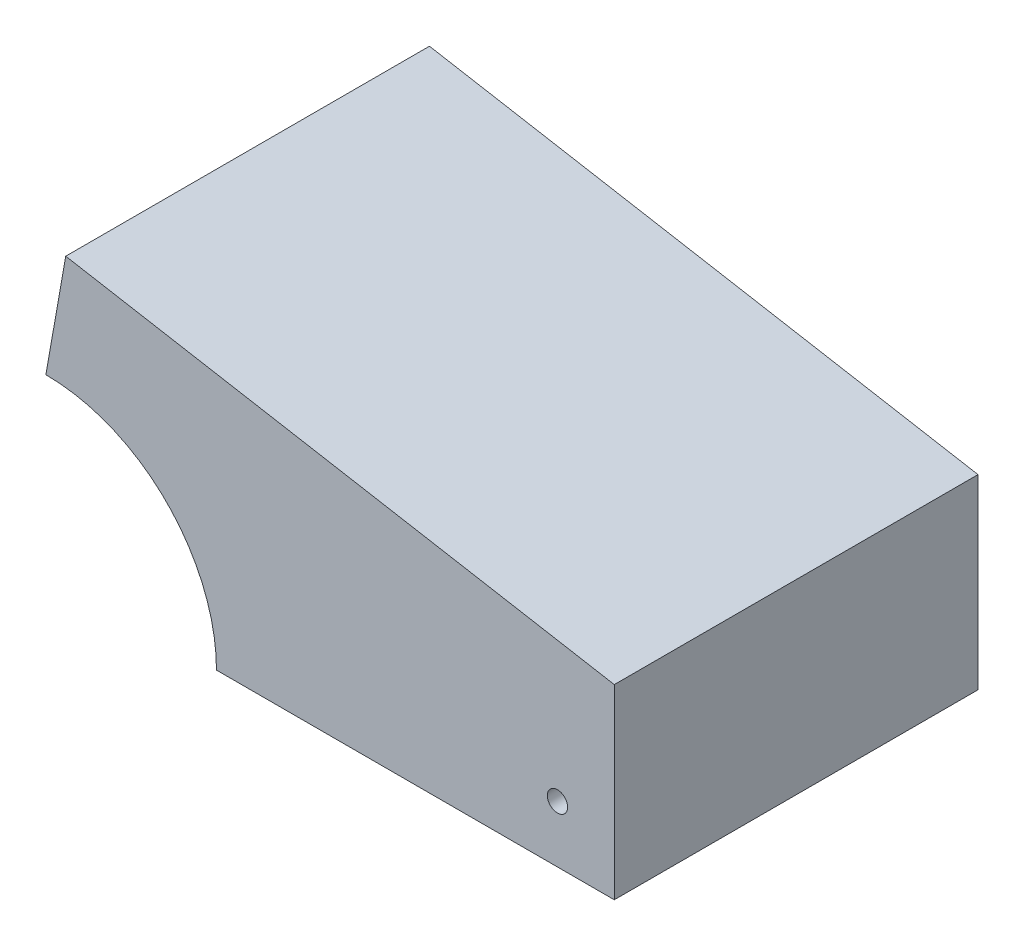
ISO-10303-21;
HEADER;
FILE_DESCRIPTION(('STEP AP214'),'2;1');
FILE_NAME('part.step','',(''),(''),'','','');
FILE_SCHEMA(('AUTOMOTIVE_DESIGN { 1 0 10303 214 1 1 1 1 }'));
ENDSEC;
DATA;
#1=APPLICATION_CONTEXT('core data for automotive mechanical design processes');
#2=APPLICATION_PROTOCOL_DEFINITION('international standard','automotive_design',2000,#1);
#3=PRODUCT_CONTEXT('',#1,'mechanical');
#4=PRODUCT('Part','Part','',(#3));
#5=PRODUCT_RELATED_PRODUCT_CATEGORY('part','',(#4));
#6=PRODUCT_DEFINITION_FORMATION('','',#4);
#7=PRODUCT_DEFINITION_CONTEXT('part definition',#1,'design');
#8=PRODUCT_DEFINITION('design','',#6,#7);
#9=PRODUCT_DEFINITION_SHAPE('','',#8);
#10=(LENGTH_UNIT() NAMED_UNIT(*) SI_UNIT(.MILLI.,.METRE.));
#11=(NAMED_UNIT(*) PLANE_ANGLE_UNIT() SI_UNIT($,.RADIAN.));
#12=(NAMED_UNIT(*) SI_UNIT($,.STERADIAN.) SOLID_ANGLE_UNIT());
#13=UNCERTAINTY_MEASURE_WITH_UNIT(LENGTH_MEASURE(1.E-05),#10,'distance_accuracy_value','');
#14=(GEOMETRIC_REPRESENTATION_CONTEXT(3) GLOBAL_UNCERTAINTY_ASSIGNED_CONTEXT((#13)) GLOBAL_UNIT_ASSIGNED_CONTEXT((#10,
#11,#12)) REPRESENTATION_CONTEXT('',''));
#15=CARTESIAN_POINT('',(0.,0.,0.));
#16=DIRECTION('',(0.,0.,1.));
#17=DIRECTION('',(1.,0.,0.));
#18=AXIS2_PLACEMENT_3D('',#15,#16,#17);
#19=CARTESIAN_POINT('',(-100.05646770604,17.6426548509602,0.));
#20=DIRECTION('',(-0.984807753012208,0.173648177666931,0.));
#21=DIRECTION('',(-0.173648177666931,-0.984807753012208,0.));
#22=AXIS2_PLACEMENT_3D('',#19,#20,#21);
#23=PLANE('',#22);
#24=DIRECTION('',(0.,0.,1.));
#25=VECTOR('',#24,1.);
#26=CARTESIAN_POINT('',(-117.024291008951,-78.5866529653242,-20.3199999999999));
#27=LINE('',#26,#25);
#28=CARTESIAN_POINT('',(-117.024291008951,-78.5866529653242,-20.3199999999999));
#29=VERTEX_POINT('',#28);
#30=CARTESIAN_POINT('',(-117.024291008951,-78.5866529653241,20.3199999999999));
#31=VERTEX_POINT('',#30);
#32=EDGE_CURVE('E146',#29,#31,#27,.T.);
#33=ORIENTED_EDGE('',*,*,#32,.T.);
#34=DIRECTION('',(0.173648177666931,0.984807753012208,0.));
#35=VECTOR('',#34,1.);
#36=CARTESIAN_POINT('',(-117.024291008951,-78.5866529653241,20.3200000000001));
#37=LINE('',#36,#35);
#38=CARTESIAN_POINT('',(-114.818959152581,-66.0795945020691,20.3200000000001));
#39=VERTEX_POINT('',#38);
#40=EDGE_CURVE('E149',#31,#39,#37,.T.);
#41=ORIENTED_EDGE('',*,*,#40,.T.);
#42=DIRECTION('',(0.,0.,-1.));
#43=VECTOR('',#42,1.);
#44=CARTESIAN_POINT('',(-114.818959152581,-66.0795945020692,-20.32));
#45=LINE('',#44,#43);
#46=CARTESIAN_POINT('',(-114.818959152581,-66.0795945020692,-20.32));
#47=VERTEX_POINT('',#46);
#48=EDGE_CURVE('E165',#39,#47,#45,.T.);
#49=ORIENTED_EDGE('',*,*,#48,.T.);
#50=DIRECTION('',(-0.173648177666931,-0.984807753012208,0.));
#51=VECTOR('',#50,1.);
#52=CARTESIAN_POINT('',(-117.024291008951,-78.5866529653242,-20.3199999999999));
#53=LINE('',#52,#51);
#54=EDGE_CURVE('E85',#47,#29,#53,.T.);
#55=ORIENTED_EDGE('',*,*,#54,.T.);
#56=EDGE_LOOP('',(#33,#41,#49,#55));
#57=FACE_BOUND('',#56,.T.);
#58=ADVANCED_FACE('F78',(#57),#23,.T.);
#59=CARTESIAN_POINT('',(65.5726331003115,81.8524678841874,20.3200000000001));
#60=DIRECTION('',(0.,0.,1.));
#61=DIRECTION('',(1.,0.,0.));
#62=AXIS2_PLACEMENT_3D('',#59,#60,#61);
#63=PLANE('',#62);
#64=CARTESIAN_POINT('',(-117.024291008951,-97.7137999999999,20.3199999999999));
#65=DIRECTION('',(0.,0.,1.));
#66=DIRECTION('',(1.,0.,0.));
#67=AXIS2_PLACEMENT_3D('',#64,#65,#66);
#68=CIRCLE('',#67,19.05);
#69=CARTESIAN_POINT('',(-97.9742910089513,-97.7137999999999,20.3199999999999));
#70=VERTEX_POINT('',#69);
#71=CARTESIAN_POINT('',(-117.024291008951,-78.6637999999999,20.3199999999999));
#72=VERTEX_POINT('',#71);
#73=EDGE_CURVE('E91',#70,#72,#68,.T.);
#74=ORIENTED_EDGE('',*,*,#73,.F.);
#75=DIRECTION('',(1.,0.,0.));
#76=VECTOR('',#75,1.);
#77=CARTESIAN_POINT('',(0.,-97.7137999999999,20.3199999999999));
#78=LINE('',#77,#76);
#79=CARTESIAN_POINT('',(-53.5242910089514,-97.7137999999999,20.3199999999999));
#80=VERTEX_POINT('',#79);
#81=EDGE_CURVE('E98',#70,#80,#78,.T.);
#82=ORIENTED_EDGE('',*,*,#81,.T.);
#83=DIRECTION('',(0.,-1.,0.));
#84=VECTOR('',#83,1.);
#85=CARTESIAN_POINT('',(-53.5242910089514,-97.7138000000001,20.3199999999999));
#86=LINE('',#85,#84);
#87=CARTESIAN_POINT('',(-53.5242910089514,-76.8874982693627,20.3199999999999));
#88=VERTEX_POINT('',#87);
#89=EDGE_CURVE('E263',#88,#80,#86,.T.);
#90=ORIENTED_EDGE('',*,*,#89,.F.);
#91=DIRECTION('',(-0.984807753012208,0.17364817766693,0.));
#92=VECTOR('',#91,1.);
#93=CARTESIAN_POINT('',(-14.7624914465408,-83.7222493530292,20.3200000000001));
#94=LINE('',#93,#92);
#95=EDGE_CURVE('E163',#88,#39,#94,.T.);
#96=ORIENTED_EDGE('',*,*,#95,.T.);
#97=ORIENTED_EDGE('',*,*,#40,.F.);
#98=DIRECTION('',(0.,-1.,0.));
#99=VECTOR('',#98,1.);
#100=CARTESIAN_POINT('',(-117.024291008951,0.,20.3199999999999));
#101=LINE('',#100,#99);
#102=EDGE_CURVE('E140',#31,#72,#101,.T.);
#103=ORIENTED_EDGE('',*,*,#102,.T.);
#104=EDGE_LOOP('',(#74,#82,#90,#96,#97,#103));
#105=FACE_BOUND('',#104,.T.);
#106=CARTESIAN_POINT('',(-59.8742910089514,-91.3638000000001,20.3199999999999));
#107=DIRECTION('',(0.,0.,1.));
#108=DIRECTION('',(1.,0.,0.));
#109=AXIS2_PLACEMENT_3D('',#106,#107,#108);
#110=CIRCLE('',#109,1.1303);
#111=CARTESIAN_POINT('',(-58.7439910089514,-91.3638000000001,20.3199999999999));
#112=VERTEX_POINT('',#111);
#113=EDGE_CURVE('E134',#112,#112,#110,.T.);
#114=ORIENTED_EDGE('',*,*,#113,.F.);
#115=EDGE_LOOP('',(#114));
#116=FACE_BOUND('',#115,.T.);
#117=ADVANCED_FACE('F137',(#105,#116),#63,.T.);
#118=CARTESIAN_POINT('',(65.5726331003115,81.8524678841875,-20.3199999999999));
#119=DIRECTION('',(0.,0.,-1.));
#120=DIRECTION('',(-1.,0.,0.));
#121=AXIS2_PLACEMENT_3D('',#118,#119,#120);
#122=PLANE('',#121);
#123=CARTESIAN_POINT('',(-117.024291008951,-97.7137999999999,-20.3200000000004));
#124=DIRECTION('',(0.,0.,1.));
#125=DIRECTION('',(1.,0.,0.));
#126=AXIS2_PLACEMENT_3D('',#123,#124,#125);
#127=CIRCLE('',#126,19.05);
#128=CARTESIAN_POINT('',(-97.9742910089513,-97.7137999999999,-20.3200000000004));
#129=VERTEX_POINT('',#128);
#130=CARTESIAN_POINT('',(-117.024291008951,-78.6637999999999,-20.3200000000004));
#131=VERTEX_POINT('',#130);
#132=EDGE_CURVE('E131',#129,#131,#127,.T.);
#133=ORIENTED_EDGE('',*,*,#132,.T.);
#134=DIRECTION('',(0.,-1.,0.));
#135=VECTOR('',#134,1.);
#136=CARTESIAN_POINT('',(-117.024291008951,3.34596504567019E-13,-20.3200000000001));
#137=LINE('',#136,#135);
#138=EDGE_CURVE('E151',#29,#131,#137,.T.);
#139=ORIENTED_EDGE('',*,*,#138,.F.);
#140=ORIENTED_EDGE('',*,*,#54,.F.);
#141=DIRECTION('',(-0.984807753012208,0.17364817766693,0.));
#142=VECTOR('',#141,1.);
#143=CARTESIAN_POINT('',(-14.7624914465408,-83.7222493530293,-20.32));
#144=LINE('',#143,#142);
#145=CARTESIAN_POINT('',(-53.5242910089514,-76.8874982693628,-20.3200000000004));
#146=VERTEX_POINT('',#145);
#147=EDGE_CURVE('E168',#146,#47,#144,.T.);
#148=ORIENTED_EDGE('',*,*,#147,.F.);
#149=DIRECTION('',(0.,-1.,0.));
#150=VECTOR('',#149,1.);
#151=CARTESIAN_POINT('',(-53.5242910089514,-97.7138000000001,-20.3200000000004));
#152=LINE('',#151,#150);
#153=CARTESIAN_POINT('',(-53.5242910089514,-97.7138000000001,-20.3200000000004));
#154=VERTEX_POINT('',#153);
#155=EDGE_CURVE('E266',#146,#154,#152,.T.);
#156=ORIENTED_EDGE('',*,*,#155,.T.);
#157=DIRECTION('',(1.,0.,0.));
#158=VECTOR('',#157,1.);
#159=CARTESIAN_POINT('',(0.,-97.7137999999999,-20.3199999999999));
#160=LINE('',#159,#158);
#161=EDGE_CURVE('E159',#129,#154,#160,.T.);
#162=ORIENTED_EDGE('',*,*,#161,.F.);
#163=EDGE_LOOP('',(#133,#139,#140,#148,#156,#162));
#164=FACE_BOUND('',#163,.T.);
#165=CARTESIAN_POINT('',(-59.8742910089514,-91.3638000000001,-20.3200000000004));
#166=DIRECTION('',(0.,0.,1.));
#167=DIRECTION('',(1.,0.,0.));
#168=AXIS2_PLACEMENT_3D('',#165,#166,#167);
#169=CIRCLE('',#168,1.1303);
#170=CARTESIAN_POINT('',(-58.7439910089514,-91.3638000000001,-20.3200000000004));
#171=VERTEX_POINT('',#170);
#172=EDGE_CURVE('E259',#171,#171,#169,.T.);
#173=ORIENTED_EDGE('',*,*,#172,.T.);
#174=EDGE_LOOP('',(#173));
#175=FACE_BOUND('',#174,.T.);
#176=ADVANCED_FACE('F176',(#164,#175),#122,.T.);
#177=CARTESIAN_POINT('',(-14.7624914465408,-83.7222493530293,-20.32));
#178=DIRECTION('',(0.17364817766693,0.984807753012208,0.));
#179=DIRECTION('',(-0.984807753012208,0.17364817766693,0.));
#180=AXIS2_PLACEMENT_3D('',#177,#178,#179);
#181=PLANE('',#180);
#182=DIRECTION('',(0.,0.,1.));
#183=VECTOR('',#182,1.);
#184=CARTESIAN_POINT('',(-53.5242910089514,-76.8874982693628,-20.32));
#185=LINE('',#184,#183);
#186=EDGE_CURVE('E154',#146,#88,#185,.T.);
#187=ORIENTED_EDGE('',*,*,#186,.F.);
#188=ORIENTED_EDGE('',*,*,#147,.T.);
#189=ORIENTED_EDGE('',*,*,#48,.F.);
#190=ORIENTED_EDGE('',*,*,#95,.F.);
#191=EDGE_LOOP('',(#187,#188,#189,#190));
#192=FACE_BOUND('',#191,.T.);
#193=ADVANCED_FACE('F192',(#192),#181,.T.);
#194=CARTESIAN_POINT('',(0.,-97.7137999999999,-158.508181191012));
#195=DIRECTION('',(0.,-1.,0.));
#196=DIRECTION('',(0.,0.,-1.));
#197=AXIS2_PLACEMENT_3D('',#194,#195,#196);
#198=PLANE('',#197);
#199=DIRECTION('',(0.,0.,1.));
#200=VECTOR('',#199,1.);
#201=CARTESIAN_POINT('',(-97.9742910089513,-97.7137999999999,-20.3200000000004));
#202=LINE('',#201,#200);
#203=EDGE_CURVE('E128',#129,#70,#202,.T.);
#204=ORIENTED_EDGE('',*,*,#203,.F.);
#205=ORIENTED_EDGE('',*,*,#161,.T.);
#206=DIRECTION('',(0.,0.,1.));
#207=VECTOR('',#206,1.);
#208=CARTESIAN_POINT('',(-53.5242910089514,-97.7138000000001,-20.3200000000004));
#209=LINE('',#208,#207);
#210=EDGE_CURVE('E145',#154,#80,#209,.T.);
#211=ORIENTED_EDGE('',*,*,#210,.T.);
#212=ORIENTED_EDGE('',*,*,#81,.F.);
#213=EDGE_LOOP('',(#204,#205,#211,#212));
#214=FACE_BOUND('',#213,.T.);
#215=ADVANCED_FACE('F143',(#214),#198,.T.);
#216=CARTESIAN_POINT('',(-117.024291008951,0.,-158.508181191012));
#217=DIRECTION('',(-1.,0.,0.));
#218=DIRECTION('',(0.,0.,1.));
#219=AXIS2_PLACEMENT_3D('',#216,#217,#218);
#220=PLANE('',#219);
#221=DIRECTION('',(0.,0.,1.));
#222=VECTOR('',#221,1.);
#223=CARTESIAN_POINT('',(-117.024291008951,-78.6637999999999,-20.3200000000004));
#224=LINE('',#223,#222);
#225=EDGE_CURVE('E12',#72,#131,#224,.F.);
#226=ORIENTED_EDGE('',*,*,#225,.F.);
#227=ORIENTED_EDGE('',*,*,#102,.F.);
#228=ORIENTED_EDGE('',*,*,#32,.F.);
#229=ORIENTED_EDGE('',*,*,#138,.T.);
#230=EDGE_LOOP('',(#226,#227,#228,#229));
#231=FACE_BOUND('',#230,.T.);
#232=ADVANCED_FACE('F180',(#231),#220,.T.);
#233=CARTESIAN_POINT('',(-53.5242910089514,-97.7138000000001,-20.3200000000004));
#234=DIRECTION('',(-1.,0.,0.));
#235=DIRECTION('',(0.,0.,1.));
#236=AXIS2_PLACEMENT_3D('',#233,#234,#235);
#237=PLANE('',#236);
#238=ORIENTED_EDGE('',*,*,#186,.T.);
#239=ORIENTED_EDGE('',*,*,#89,.T.);
#240=ORIENTED_EDGE('',*,*,#210,.F.);
#241=ORIENTED_EDGE('',*,*,#155,.F.);
#242=EDGE_LOOP('',(#238,#239,#240,#241));
#243=FACE_BOUND('',#242,.T.);
#244=ADVANCED_FACE('F182',(#243),#237,.F.);
#245=CARTESIAN_POINT('',(-59.8742910089514,-91.3638000000001,-20.3200000000004));
#246=DIRECTION('',(0.,0.,1.));
#247=DIRECTION('',(1.,0.,0.));
#248=AXIS2_PLACEMENT_3D('',#245,#246,#247);
#249=CYLINDRICAL_SURFACE('',#248,1.1303);
#250=ORIENTED_EDGE('',*,*,#172,.F.);
#251=EDGE_LOOP('',(#250));
#252=FACE_BOUND('',#251,.T.);
#253=ORIENTED_EDGE('',*,*,#113,.T.);
#254=EDGE_LOOP('',(#253));
#255=FACE_BOUND('',#254,.T.);
#256=ADVANCED_FACE('F189',(#252,#255),#249,.F.);
#257=CARTESIAN_POINT('',(-117.024291008951,-97.7137999999999,-20.3200000000004));
#258=DIRECTION('',(0.,0.,1.));
#259=DIRECTION('',(1.,0.,0.));
#260=AXIS2_PLACEMENT_3D('',#257,#258,#259);
#261=CYLINDRICAL_SURFACE('',#260,19.05);
#262=ORIENTED_EDGE('',*,*,#203,.T.);
#263=ORIENTED_EDGE('',*,*,#73,.T.);
#264=ORIENTED_EDGE('',*,*,#225,.T.);
#265=ORIENTED_EDGE('',*,*,#132,.F.);
#266=EDGE_LOOP('',(#262,#263,#264,#265));
#267=FACE_BOUND('',#266,.T.);
#268=ADVANCED_FACE('F129',(#267),#261,.F.);
#269=CLOSED_SHELL('',(#58,#117,#176,#193,#215,#232,#244,#256,#268));
#270=MANIFOLD_SOLID_BREP('B2',#269);
#271=ADVANCED_BREP_SHAPE_REPRESENTATION('',(#18,#270),#14);
#272=SHAPE_DEFINITION_REPRESENTATION(#9,#271);
ENDSEC;
END-ISO-10303-21;
